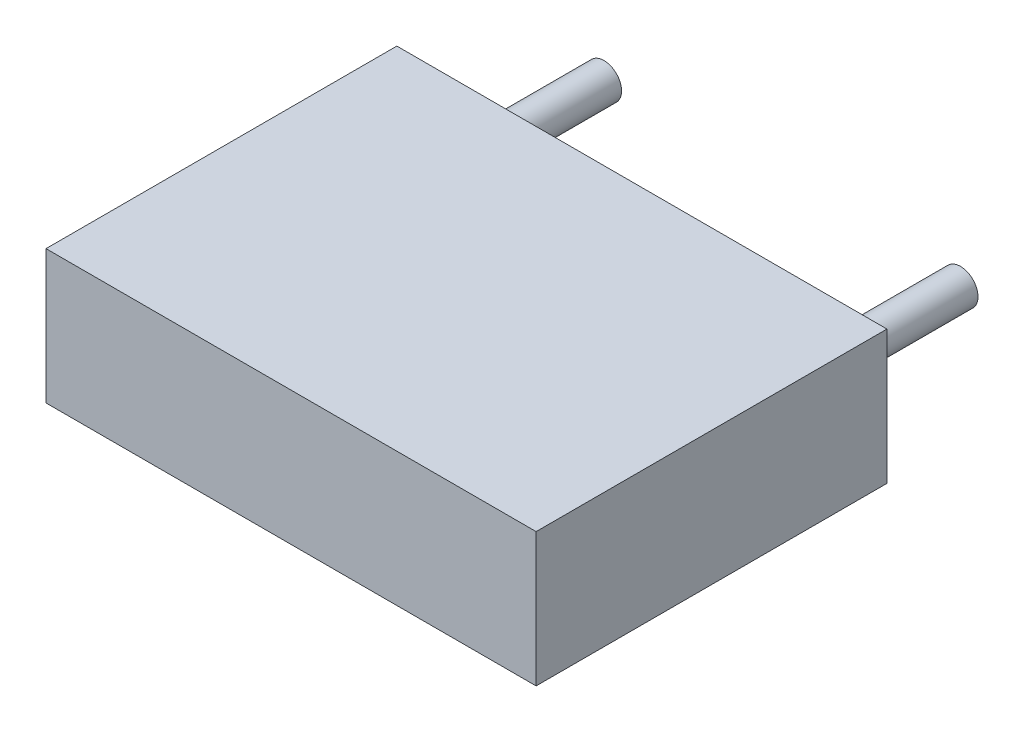
ISO-10303-21;
HEADER;
FILE_DESCRIPTION(('STEP AP214'),'2;1');
FILE_NAME('part.step','',(''),(''),'','','');
FILE_SCHEMA(('AUTOMOTIVE_DESIGN { 1 0 10303 214 1 1 1 1 }'));
ENDSEC;
DATA;
#1=APPLICATION_CONTEXT('core data for automotive mechanical design processes');
#2=APPLICATION_PROTOCOL_DEFINITION('international standard','automotive_design',2000,#1);
#3=PRODUCT_CONTEXT('',#1,'mechanical');
#4=PRODUCT('Part','Part','',(#3));
#5=PRODUCT_RELATED_PRODUCT_CATEGORY('part','',(#4));
#6=PRODUCT_DEFINITION_FORMATION('','',#4);
#7=PRODUCT_DEFINITION_CONTEXT('part definition',#1,'design');
#8=PRODUCT_DEFINITION('design','',#6,#7);
#9=PRODUCT_DEFINITION_SHAPE('','',#8);
#10=(LENGTH_UNIT() NAMED_UNIT(*) SI_UNIT(.MILLI.,.METRE.));
#11=(NAMED_UNIT(*) PLANE_ANGLE_UNIT() SI_UNIT($,.RADIAN.));
#12=(NAMED_UNIT(*) SI_UNIT($,.STERADIAN.) SOLID_ANGLE_UNIT());
#13=UNCERTAINTY_MEASURE_WITH_UNIT(LENGTH_MEASURE(1.E-05),#10,'distance_accuracy_value','');
#14=(GEOMETRIC_REPRESENTATION_CONTEXT(3) GLOBAL_UNCERTAINTY_ASSIGNED_CONTEXT((#13)) GLOBAL_UNIT_ASSIGNED_CONTEXT((#10,
#11,#12)) REPRESENTATION_CONTEXT('',''));
#15=CARTESIAN_POINT('',(0.,0.,0.));
#16=DIRECTION('',(0.,0.,1.));
#17=DIRECTION('',(1.,0.,0.));
#18=AXIS2_PLACEMENT_3D('',#15,#16,#17);
#19=CARTESIAN_POINT('',(5.08,0.,-2.));
#20=DIRECTION('',(0.,0.,1.));
#21=DIRECTION('',(1.,0.,0.));
#22=AXIS2_PLACEMENT_3D('',#19,#20,#21);
#23=CYLINDRICAL_SURFACE('',#22,0.25);
#24=CARTESIAN_POINT('',(5.08,0.,-2.));
#25=DIRECTION('',(0.,0.,1.));
#26=DIRECTION('',(1.,0.,0.));
#27=AXIS2_PLACEMENT_3D('',#24,#25,#26);
#28=CIRCLE('',#27,0.25);
#29=CARTESIAN_POINT('',(5.33,0.,-2.));
#30=VERTEX_POINT('',#29);
#31=EDGE_CURVE('E11',#30,#30,#28,.T.);
#32=ORIENTED_EDGE('',*,*,#31,.T.);
#33=EDGE_LOOP('',(#32));
#34=FACE_BOUND('',#33,.T.);
#35=CARTESIAN_POINT('',(5.08,0.,0.));
#36=DIRECTION('',(0.,0.,1.));
#37=DIRECTION('',(1.,0.,0.));
#38=AXIS2_PLACEMENT_3D('',#35,#36,#37);
#39=CIRCLE('',#38,0.25);
#40=CARTESIAN_POINT('',(5.33,0.,0.));
#41=VERTEX_POINT('',#40);
#42=EDGE_CURVE('E43',#41,#41,#39,.T.);
#43=ORIENTED_EDGE('',*,*,#42,.F.);
#44=EDGE_LOOP('',(#43));
#45=FACE_BOUND('',#44,.T.);
#46=ADVANCED_FACE('F40',(#34,#45),#23,.T.);
#47=CARTESIAN_POINT('',(5.08,0.,-2.));
#48=DIRECTION('',(0.,0.,1.));
#49=DIRECTION('',(1.,0.,0.));
#50=AXIS2_PLACEMENT_3D('',#47,#48,#49);
#51=PLANE('',#50);
#52=ORIENTED_EDGE('',*,*,#31,.F.);
#53=EDGE_LOOP('',(#52));
#54=FACE_BOUND('',#53,.T.);
#55=ADVANCED_FACE('F55',(#54),#51,.F.);
#56=CARTESIAN_POINT('',(5.08,0.,0.));
#57=DIRECTION('',(0.,0.,1.));
#58=DIRECTION('',(1.,0.,0.));
#59=AXIS2_PLACEMENT_3D('',#56,#57,#58);
#60=PLANE('',#59);
#61=ORIENTED_EDGE('',*,*,#42,.T.);
#62=EDGE_LOOP('',(#61));
#63=FACE_BOUND('',#62,.T.);
#64=ADVANCED_FACE('F52',(#63),#60,.T.);
#65=CLOSED_SHELL('',(#46,#55,#64));
#66=MANIFOLD_SOLID_BREP('B2',#65);
#67=CARTESIAN_POINT('',(0.,0.,-2.));
#68=DIRECTION('',(0.,0.,1.));
#69=DIRECTION('',(1.,0.,0.));
#70=AXIS2_PLACEMENT_3D('',#67,#68,#69);
#71=CYLINDRICAL_SURFACE('',#70,0.25);
#72=CARTESIAN_POINT('',(0.,0.,-2.));
#73=DIRECTION('',(0.,0.,1.));
#74=DIRECTION('',(1.,0.,0.));
#75=AXIS2_PLACEMENT_3D('',#72,#73,#74);
#76=CIRCLE('',#75,0.25);
#77=CARTESIAN_POINT('',(0.25,0.,-2.));
#78=VERTEX_POINT('',#77);
#79=EDGE_CURVE('E39',#78,#78,#76,.T.);
#80=ORIENTED_EDGE('',*,*,#79,.T.);
#81=EDGE_LOOP('',(#80));
#82=FACE_BOUND('',#81,.T.);
#83=CARTESIAN_POINT('',(0.,0.,0.));
#84=DIRECTION('',(0.,0.,1.));
#85=DIRECTION('',(1.,0.,0.));
#86=AXIS2_PLACEMENT_3D('',#83,#84,#85);
#87=CIRCLE('',#86,0.25);
#88=CARTESIAN_POINT('',(0.25,0.,0.));
#89=VERTEX_POINT('',#88);
#90=EDGE_CURVE('E93',#89,#89,#87,.T.);
#91=ORIENTED_EDGE('',*,*,#90,.F.);
#92=EDGE_LOOP('',(#91));
#93=FACE_BOUND('',#92,.T.);
#94=ADVANCED_FACE('F90',(#82,#93),#71,.T.);
#95=CARTESIAN_POINT('',(0.,0.,-2.));
#96=DIRECTION('',(0.,0.,1.));
#97=DIRECTION('',(1.,0.,0.));
#98=AXIS2_PLACEMENT_3D('',#95,#96,#97);
#99=PLANE('',#98);
#100=ORIENTED_EDGE('',*,*,#79,.F.);
#101=EDGE_LOOP('',(#100));
#102=FACE_BOUND('',#101,.T.);
#103=ADVANCED_FACE('F105',(#102),#99,.F.);
#104=CARTESIAN_POINT('',(0.,0.,0.));
#105=DIRECTION('',(0.,0.,1.));
#106=DIRECTION('',(1.,0.,0.));
#107=AXIS2_PLACEMENT_3D('',#104,#105,#106);
#108=PLANE('',#107);
#109=ORIENTED_EDGE('',*,*,#90,.T.);
#110=EDGE_LOOP('',(#109));
#111=FACE_BOUND('',#110,.T.);
#112=ADVANCED_FACE('F102',(#111),#108,.T.);
#113=CLOSED_SHELL('',(#94,#103,#112));
#114=MANIFOLD_SOLID_BREP('B6',#113);
#115=CARTESIAN_POINT('',(6.0325,0.9525,5.));
#116=DIRECTION('',(0.,-1.,0.));
#117=DIRECTION('',(0.,0.,-1.));
#118=AXIS2_PLACEMENT_3D('',#115,#116,#117);
#119=PLANE('',#118);
#120=DIRECTION('',(-1.,0.,0.));
#121=VECTOR('',#120,1.);
#122=CARTESIAN_POINT('',(6.0325,0.9525,0.));
#123=LINE('',#122,#121);
#124=CARTESIAN_POINT('',(6.0325,0.9525,0.));
#125=VERTEX_POINT('',#124);
#126=CARTESIAN_POINT('',(-0.9525,0.9525,0.));
#127=VERTEX_POINT('',#126);
#128=EDGE_CURVE('E194',#125,#127,#123,.T.);
#129=ORIENTED_EDGE('',*,*,#128,.T.);
#130=DIRECTION('',(0.,0.,-1.));
#131=VECTOR('',#130,1.);
#132=CARTESIAN_POINT('',(-0.9525,0.9525,5.));
#133=LINE('',#132,#131);
#134=CARTESIAN_POINT('',(-0.9525,0.9525,5.));
#135=VERTEX_POINT('',#134);
#136=EDGE_CURVE('E88',#135,#127,#133,.T.);
#137=ORIENTED_EDGE('',*,*,#136,.F.);
#138=DIRECTION('',(-1.,0.,0.));
#139=VECTOR('',#138,1.);
#140=CARTESIAN_POINT('',(6.0325,0.9525,5.));
#141=LINE('',#140,#139);
#142=CARTESIAN_POINT('',(6.0325,0.9525,5.));
#143=VERTEX_POINT('',#142);
#144=EDGE_CURVE('E182',#143,#135,#141,.T.);
#145=ORIENTED_EDGE('',*,*,#144,.F.);
#146=DIRECTION('',(0.,0.,-1.));
#147=VECTOR('',#146,1.);
#148=CARTESIAN_POINT('',(6.0325,0.9525,5.));
#149=LINE('',#148,#147);
#150=EDGE_CURVE('E190',#143,#125,#149,.T.);
#151=ORIENTED_EDGE('',*,*,#150,.T.);
#152=EDGE_LOOP('',(#129,#137,#145,#151));
#153=FACE_BOUND('',#152,.T.);
#154=ADVANCED_FACE('F131',(#153),#119,.F.);
#155=CARTESIAN_POINT('',(-0.9525,0.9525,5.));
#156=DIRECTION('',(1.,0.,0.));
#157=DIRECTION('',(0.,0.,-1.));
#158=AXIS2_PLACEMENT_3D('',#155,#156,#157);
#159=PLANE('',#158);
#160=DIRECTION('',(0.,-1.,0.));
#161=VECTOR('',#160,1.);
#162=CARTESIAN_POINT('',(-0.9525,0.9525,0.));
#163=LINE('',#162,#161);
#164=CARTESIAN_POINT('',(-0.9525,-0.9525,0.));
#165=VERTEX_POINT('',#164);
#166=EDGE_CURVE('E186',#127,#165,#163,.T.);
#167=ORIENTED_EDGE('',*,*,#166,.T.);
#168=DIRECTION('',(0.,0.,-1.));
#169=VECTOR('',#168,1.);
#170=CARTESIAN_POINT('',(-0.9525,-0.9525,5.));
#171=LINE('',#170,#169);
#172=CARTESIAN_POINT('',(-0.9525,-0.9525,5.));
#173=VERTEX_POINT('',#172);
#174=EDGE_CURVE('E139',#173,#165,#171,.T.);
#175=ORIENTED_EDGE('',*,*,#174,.F.);
#176=DIRECTION('',(0.,-1.,0.));
#177=VECTOR('',#176,1.);
#178=CARTESIAN_POINT('',(-0.9525,0.9525,5.));
#179=LINE('',#178,#177);
#180=EDGE_CURVE('E177',#135,#173,#179,.T.);
#181=ORIENTED_EDGE('',*,*,#180,.F.);
#182=ORIENTED_EDGE('',*,*,#136,.T.);
#183=EDGE_LOOP('',(#167,#175,#181,#182));
#184=FACE_BOUND('',#183,.T.);
#185=ADVANCED_FACE('F185',(#184),#159,.F.);
#186=CARTESIAN_POINT('',(-0.9525,-0.9525,5.));
#187=DIRECTION('',(0.,1.,0.));
#188=DIRECTION('',(0.,0.,1.));
#189=AXIS2_PLACEMENT_3D('',#186,#187,#188);
#190=PLANE('',#189);
#191=DIRECTION('',(1.,0.,0.));
#192=VECTOR('',#191,1.);
#193=CARTESIAN_POINT('',(-0.9525,-0.9525,0.));
#194=LINE('',#193,#192);
#195=CARTESIAN_POINT('',(6.0325,-0.9525,0.));
#196=VERTEX_POINT('',#195);
#197=EDGE_CURVE('E164',#165,#196,#194,.T.);
#198=ORIENTED_EDGE('',*,*,#197,.T.);
#199=DIRECTION('',(0.,0.,-1.));
#200=VECTOR('',#199,1.);
#201=CARTESIAN_POINT('',(6.0325,-0.9525,5.));
#202=LINE('',#201,#200);
#203=CARTESIAN_POINT('',(6.0325,-0.9525,5.));
#204=VERTEX_POINT('',#203);
#205=EDGE_CURVE('E187',#204,#196,#202,.T.);
#206=ORIENTED_EDGE('',*,*,#205,.F.);
#207=DIRECTION('',(1.,0.,0.));
#208=VECTOR('',#207,1.);
#209=CARTESIAN_POINT('',(-0.9525,-0.9525,5.));
#210=LINE('',#209,#208);
#211=EDGE_CURVE('E180',#173,#204,#210,.T.);
#212=ORIENTED_EDGE('',*,*,#211,.F.);
#213=ORIENTED_EDGE('',*,*,#174,.T.);
#214=EDGE_LOOP('',(#198,#206,#212,#213));
#215=FACE_BOUND('',#214,.T.);
#216=ADVANCED_FACE('F188',(#215),#190,.F.);
#217=CARTESIAN_POINT('',(6.0325,-0.9525,5.));
#218=DIRECTION('',(-1.,0.,0.));
#219=DIRECTION('',(0.,0.,1.));
#220=AXIS2_PLACEMENT_3D('',#217,#218,#219);
#221=PLANE('',#220);
#222=DIRECTION('',(0.,1.,0.));
#223=VECTOR('',#222,1.);
#224=CARTESIAN_POINT('',(6.0325,-0.9525,0.));
#225=LINE('',#224,#223);
#226=EDGE_CURVE('E170',#196,#125,#225,.T.);
#227=ORIENTED_EDGE('',*,*,#226,.T.);
#228=ORIENTED_EDGE('',*,*,#150,.F.);
#229=DIRECTION('',(0.,1.,0.));
#230=VECTOR('',#229,1.);
#231=CARTESIAN_POINT('',(6.0325,-0.9525,5.));
#232=LINE('',#231,#230);
#233=EDGE_CURVE('E147',#204,#143,#232,.T.);
#234=ORIENTED_EDGE('',*,*,#233,.F.);
#235=ORIENTED_EDGE('',*,*,#205,.T.);
#236=EDGE_LOOP('',(#227,#228,#234,#235));
#237=FACE_BOUND('',#236,.T.);
#238=ADVANCED_FACE('F201',(#237),#221,.F.);
#239=CARTESIAN_POINT('',(0.,0.,5.));
#240=DIRECTION('',(0.,0.,1.));
#241=DIRECTION('',(1.,0.,0.));
#242=AXIS2_PLACEMENT_3D('',#239,#240,#241);
#243=PLANE('',#242);
#244=ORIENTED_EDGE('',*,*,#144,.T.);
#245=ORIENTED_EDGE('',*,*,#180,.T.);
#246=ORIENTED_EDGE('',*,*,#211,.T.);
#247=ORIENTED_EDGE('',*,*,#233,.T.);
#248=EDGE_LOOP('',(#244,#245,#246,#247));
#249=FACE_BOUND('',#248,.T.);
#250=ADVANCED_FACE('F178',(#249),#243,.T.);
#251=CARTESIAN_POINT('',(0.,0.,0.));
#252=DIRECTION('',(0.,0.,1.));
#253=DIRECTION('',(1.,0.,0.));
#254=AXIS2_PLACEMENT_3D('',#251,#252,#253);
#255=PLANE('',#254);
#256=ORIENTED_EDGE('',*,*,#128,.F.);
#257=ORIENTED_EDGE('',*,*,#226,.F.);
#258=ORIENTED_EDGE('',*,*,#197,.F.);
#259=ORIENTED_EDGE('',*,*,#166,.F.);
#260=EDGE_LOOP('',(#256,#257,#258,#259));
#261=FACE_BOUND('',#260,.T.);
#262=ADVANCED_FACE('F204',(#261),#255,.F.);
#263=CLOSED_SHELL('',(#154,#185,#216,#238,#250,#262));
#264=MANIFOLD_SOLID_BREP('B34',#263);
#265=ADVANCED_BREP_SHAPE_REPRESENTATION('',(#18,#66,#114,#264),#14);
#266=SHAPE_DEFINITION_REPRESENTATION(#9,#265);
ENDSEC;
END-ISO-10303-21;
